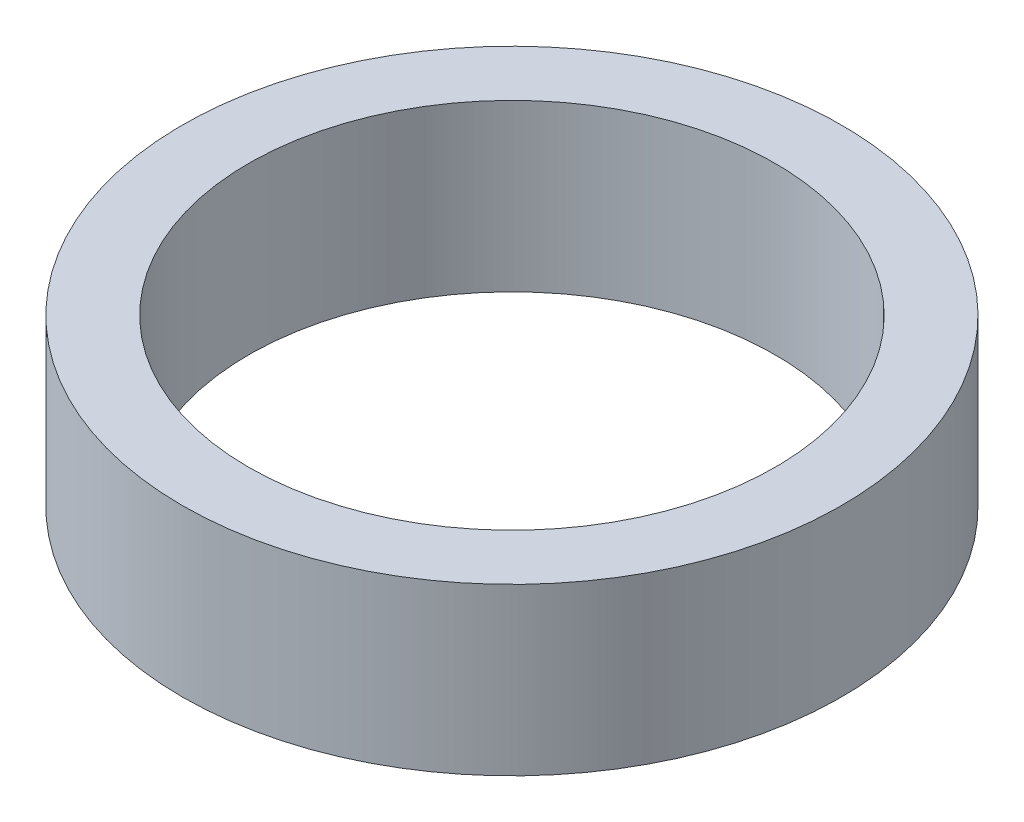
ISO-10303-21;
HEADER;
FILE_DESCRIPTION(('STEP AP214'),'2;1');
FILE_NAME('part.step','',(''),(''),'','','');
FILE_SCHEMA(('AUTOMOTIVE_DESIGN { 1 0 10303 214 1 1 1 1 }'));
ENDSEC;
DATA;
#1=APPLICATION_CONTEXT('core data for automotive mechanical design processes');
#2=APPLICATION_PROTOCOL_DEFINITION('international standard','automotive_design',2000,#1);
#3=PRODUCT_CONTEXT('',#1,'mechanical');
#4=PRODUCT('Part','Part','',(#3));
#5=PRODUCT_RELATED_PRODUCT_CATEGORY('part','',(#4));
#6=PRODUCT_DEFINITION_FORMATION('','',#4);
#7=PRODUCT_DEFINITION_CONTEXT('part definition',#1,'design');
#8=PRODUCT_DEFINITION('design','',#6,#7);
#9=PRODUCT_DEFINITION_SHAPE('','',#8);
#10=(LENGTH_UNIT() NAMED_UNIT(*) SI_UNIT(.MILLI.,.METRE.));
#11=(NAMED_UNIT(*) PLANE_ANGLE_UNIT() SI_UNIT($,.RADIAN.));
#12=(NAMED_UNIT(*) SI_UNIT($,.STERADIAN.) SOLID_ANGLE_UNIT());
#13=UNCERTAINTY_MEASURE_WITH_UNIT(LENGTH_MEASURE(1.E-05),#10,'distance_accuracy_value','');
#14=(GEOMETRIC_REPRESENTATION_CONTEXT(3) GLOBAL_UNCERTAINTY_ASSIGNED_CONTEXT((#13)) GLOBAL_UNIT_ASSIGNED_CONTEXT((#10,
#11,#12)) REPRESENTATION_CONTEXT('',''));
#15=CARTESIAN_POINT('',(0.,0.,0.));
#16=DIRECTION('',(0.,0.,1.));
#17=DIRECTION('',(1.,0.,0.));
#18=AXIS2_PLACEMENT_3D('',#15,#16,#17);
#19=CARTESIAN_POINT('',(0.,3.96875,0.));
#20=DIRECTION('',(0.,1.,0.));
#21=DIRECTION('',(0.,0.,1.));
#22=AXIS2_PLACEMENT_3D('',#19,#20,#21);
#23=PLANE('',#22);
#24=CARTESIAN_POINT('',(0.,3.96875,0.));
#25=DIRECTION('',(0.,1.,0.));
#26=DIRECTION('',(0.,0.,1.));
#27=AXIS2_PLACEMENT_3D('',#24,#25,#26);
#28=CIRCLE('',#27,15.775);
#29=CARTESIAN_POINT('',(0.,3.96875,15.775));
#30=VERTEX_POINT('',#29);
#31=EDGE_CURVE('E10',#30,#30,#28,.T.);
#32=ORIENTED_EDGE('',*,*,#31,.T.);
#33=EDGE_LOOP('',(#32));
#34=FACE_BOUND('',#33,.T.);
#35=CARTESIAN_POINT('',(0.,3.96875,0.));
#36=DIRECTION('',(0.,1.,0.));
#37=DIRECTION('',(0.,0.,1.));
#38=AXIS2_PLACEMENT_3D('',#35,#36,#37);
#39=CIRCLE('',#38,12.6);
#40=CARTESIAN_POINT('',(0.,3.96875,12.6));
#41=VERTEX_POINT('',#40);
#42=EDGE_CURVE('E42',#41,#41,#39,.T.);
#43=ORIENTED_EDGE('',*,*,#42,.F.);
#44=EDGE_LOOP('',(#43));
#45=FACE_BOUND('',#44,.T.);
#46=ADVANCED_FACE('F31',(#34,#45),#23,.T.);
#47=CARTESIAN_POINT('',(0.,-3.96875,0.));
#48=DIRECTION('',(0.,1.,0.));
#49=DIRECTION('',(0.,0.,1.));
#50=AXIS2_PLACEMENT_3D('',#47,#48,#49);
#51=PLANE('',#50);
#52=CARTESIAN_POINT('',(0.,-3.96875,0.));
#53=DIRECTION('',(0.,1.,0.));
#54=DIRECTION('',(0.,0.,1.));
#55=AXIS2_PLACEMENT_3D('',#52,#53,#54);
#56=CIRCLE('',#55,15.775);
#57=CARTESIAN_POINT('',(0.,-3.96875,15.775));
#58=VERTEX_POINT('',#57);
#59=EDGE_CURVE('E35',#58,#58,#56,.T.);
#60=ORIENTED_EDGE('',*,*,#59,.F.);
#61=EDGE_LOOP('',(#60));
#62=FACE_BOUND('',#61,.T.);
#63=CARTESIAN_POINT('',(0.,-3.96875,0.));
#64=DIRECTION('',(0.,1.,0.));
#65=DIRECTION('',(0.,0.,1.));
#66=AXIS2_PLACEMENT_3D('',#63,#64,#65);
#67=CIRCLE('',#66,12.6);
#68=CARTESIAN_POINT('',(0.,-3.96875,12.6));
#69=VERTEX_POINT('',#68);
#70=EDGE_CURVE('E44',#69,#69,#67,.T.);
#71=ORIENTED_EDGE('',*,*,#70,.T.);
#72=EDGE_LOOP('',(#71));
#73=FACE_BOUND('',#72,.T.);
#74=ADVANCED_FACE('F54',(#62,#73),#51,.F.);
#75=CARTESIAN_POINT('',(0.,3.96875,0.));
#76=DIRECTION('',(0.,-1.,0.));
#77=DIRECTION('',(0.,0.,-1.));
#78=AXIS2_PLACEMENT_3D('',#75,#76,#77);
#79=CYLINDRICAL_SURFACE('',#78,15.775);
#80=ORIENTED_EDGE('',*,*,#31,.F.);
#81=EDGE_LOOP('',(#80));
#82=FACE_BOUND('',#81,.T.);
#83=ORIENTED_EDGE('',*,*,#59,.T.);
#84=EDGE_LOOP('',(#83));
#85=FACE_BOUND('',#84,.T.);
#86=ADVANCED_FACE('F33',(#82,#85),#79,.T.);
#87=CARTESIAN_POINT('',(0.,3.96875,0.));
#88=DIRECTION('',(0.,-1.,0.));
#89=DIRECTION('',(0.,0.,-1.));
#90=AXIS2_PLACEMENT_3D('',#87,#88,#89);
#91=CYLINDRICAL_SURFACE('',#90,12.6);
#92=ORIENTED_EDGE('',*,*,#42,.T.);
#93=EDGE_LOOP('',(#92));
#94=FACE_BOUND('',#93,.T.);
#95=ORIENTED_EDGE('',*,*,#70,.F.);
#96=EDGE_LOOP('',(#95));
#97=FACE_BOUND('',#96,.T.);
#98=ADVANCED_FACE('F50',(#94,#97),#91,.F.);
#99=CLOSED_SHELL('',(#46,#74,#86,#98));
#100=MANIFOLD_SOLID_BREP('B2',#99);
#101=ADVANCED_BREP_SHAPE_REPRESENTATION('',(#18,#100),#14);
#102=SHAPE_DEFINITION_REPRESENTATION(#9,#101);
ENDSEC;
END-ISO-10303-21;
